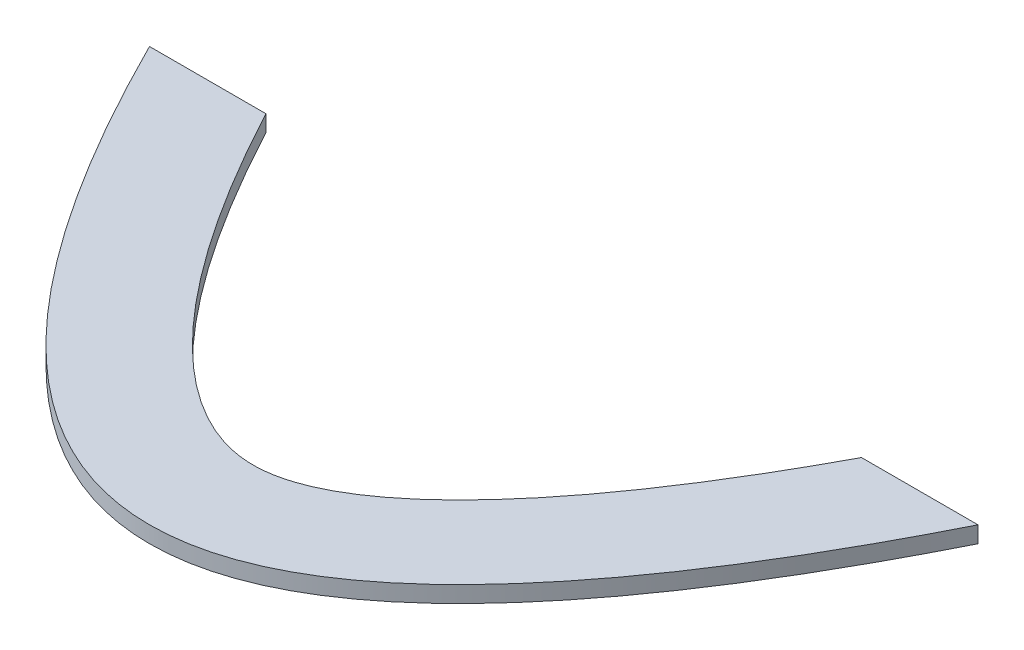
ISO-10303-21;
HEADER;
FILE_DESCRIPTION(('STEP AP214'),'2;1');
FILE_NAME('part.step','',(''),(''),'','','');
FILE_SCHEMA(('AUTOMOTIVE_DESIGN { 1 0 10303 214 1 1 1 1 }'));
ENDSEC;
DATA;
#1=APPLICATION_CONTEXT('core data for automotive mechanical design processes');
#2=APPLICATION_PROTOCOL_DEFINITION('international standard','automotive_design',2000,#1);
#3=PRODUCT_CONTEXT('',#1,'mechanical');
#4=PRODUCT('Part','Part','',(#3));
#5=PRODUCT_RELATED_PRODUCT_CATEGORY('part','',(#4));
#6=PRODUCT_DEFINITION_FORMATION('','',#4);
#7=PRODUCT_DEFINITION_CONTEXT('part definition',#1,'design');
#8=PRODUCT_DEFINITION('design','',#6,#7);
#9=PRODUCT_DEFINITION_SHAPE('','',#8);
#10=(LENGTH_UNIT() NAMED_UNIT(*) SI_UNIT(.MILLI.,.METRE.));
#11=(NAMED_UNIT(*) PLANE_ANGLE_UNIT() SI_UNIT($,.RADIAN.));
#12=(NAMED_UNIT(*) SI_UNIT($,.STERADIAN.) SOLID_ANGLE_UNIT());
#13=UNCERTAINTY_MEASURE_WITH_UNIT(LENGTH_MEASURE(1.E-05),#10,'distance_accuracy_value','');
#14=(GEOMETRIC_REPRESENTATION_CONTEXT(3) GLOBAL_UNCERTAINTY_ASSIGNED_CONTEXT((#13)) GLOBAL_UNIT_ASSIGNED_CONTEXT((#10,
#11,#12)) REPRESENTATION_CONTEXT('',''));
#15=CARTESIAN_POINT('',(0.,0.,0.));
#16=DIRECTION('',(0.,0.,1.));
#17=DIRECTION('',(1.,0.,0.));
#18=AXIS2_PLACEMENT_3D('',#15,#16,#17);
#19=CARTESIAN_POINT('',(-80.000000000081,3.175,-80.0000000001619));
#20=CARTESIAN_POINT('',(-1.79663575683442E-10,3.175,79.9999999998026));
#21=CARTESIAN_POINT('',(79.9999999997217,3.175,-79.9999999994433));
#22=B_SPLINE_CURVE_WITH_KNOTS('',2,(#19,#20,#21),.UNSPECIFIED.,.F.,.F.,(3,3),
(0.0560283962323778,0.943971603765628),.UNSPECIFIED.);
#23=DIRECTION('',(0.,-1.,0.));
#24=VECTOR('',#23,1.);
#25=SURFACE_OF_LINEAR_EXTRUSION('',#22,#24);
#26=CARTESIAN_POINT('',(-80.000000000081,0.,-80.0000000001619));
#27=CARTESIAN_POINT('',(-1.79663575683442E-10,0.,79.9999999998026));
#28=CARTESIAN_POINT('',(79.9999999997217,0.,-79.9999999994433));
#29=B_SPLINE_CURVE_WITH_KNOTS('',2,(#26,#27,#28),.UNSPECIFIED.,.F.,.F.,(3,3),
(0.0560283962323778,0.943971603765628),.UNSPECIFIED.);
#30=CARTESIAN_POINT('',(-80.000000000054,0.,-80.000000000108));
#31=VERTEX_POINT('',#30);
#32=CARTESIAN_POINT('',(80.0000000001213,0.,-79.9999999992711));
#33=VERTEX_POINT('',#32);
#34=EDGE_CURVE('E114',#31,#33,#29,.T.);
#35=ORIENTED_EDGE('',*,*,#34,.T.);
#36=DIRECTION('',(0.,-1.,0.));
#37=VECTOR('',#36,1.);
#38=CARTESIAN_POINT('',(80.0000000001213,3.175,-79.9999999992711));
#39=LINE('',#38,#37);
#40=CARTESIAN_POINT('',(80.0000000001213,3.175,-79.9999999992711));
#41=VERTEX_POINT('',#40);
#42=EDGE_CURVE('E11',#41,#33,#39,.T.);
#43=ORIENTED_EDGE('',*,*,#42,.F.);
#44=CARTESIAN_POINT('',(-80.000000000054,3.175,-80.000000000108));
#45=VERTEX_POINT('',#44);
#46=EDGE_CURVE('E84',#45,#41,#22,.T.);
#47=ORIENTED_EDGE('',*,*,#46,.F.);
#48=DIRECTION('',(0.,-1.,0.));
#49=VECTOR('',#48,1.);
#50=CARTESIAN_POINT('',(-80.000000000054,3.175,-80.000000000108));
#51=LINE('',#50,#49);
#52=EDGE_CURVE('E51',#45,#31,#51,.T.);
#53=ORIENTED_EDGE('',*,*,#52,.T.);
#54=EDGE_LOOP('',(#35,#43,#47,#53));
#55=FACE_BOUND('',#54,.T.);
#56=ADVANCED_FACE('F34',(#55),#25,.F.);
#57=CARTESIAN_POINT('',(80.0000000001213,3.175,-79.9999999992711));
#58=DIRECTION('',(0.,0.,1.));
#59=DIRECTION('',(1.,0.,0.));
#60=AXIS2_PLACEMENT_3D('',#57,#58,#59);
#61=PLANE('',#60);
#62=DIRECTION('',(-1.,0.,0.));
#63=VECTOR('',#62,1.);
#64=CARTESIAN_POINT('',(80.0000000001213,0.,-79.9999999992711));
#65=LINE('',#64,#63);
#66=CARTESIAN_POINT('',(57.4998467444385,0.,-80.0000007880775));
#67=VERTEX_POINT('',#66);
#68=EDGE_CURVE('E89',#33,#67,#65,.T.);
#69=ORIENTED_EDGE('',*,*,#68,.T.);
#70=DIRECTION('',(0.,-1.,0.));
#71=VECTOR('',#70,1.);
#72=CARTESIAN_POINT('',(57.4998467444385,3.175,-80.0000007880775));
#73=LINE('',#72,#71);
#74=CARTESIAN_POINT('',(57.4998467444385,3.175,-80.0000007880775));
#75=VERTEX_POINT('',#74);
#76=EDGE_CURVE('E43',#75,#67,#73,.T.);
#77=ORIENTED_EDGE('',*,*,#76,.F.);
#78=DIRECTION('',(-1.,0.,0.));
#79=VECTOR('',#78,1.);
#80=CARTESIAN_POINT('',(80.0000000001213,3.175,-79.9999999992711));
#81=LINE('',#80,#79);
#82=EDGE_CURVE('E76',#41,#75,#81,.T.);
#83=ORIENTED_EDGE('',*,*,#82,.F.);
#84=ORIENTED_EDGE('',*,*,#42,.T.);
#85=EDGE_LOOP('',(#69,#77,#83,#84));
#86=FACE_BOUND('',#85,.T.);
#87=ADVANCED_FACE('F88',(#86),#61,.F.);
#88=CARTESIAN_POINT('',(-62.1114561800424,3.175,-88.9442719100806));
#89=CARTESIAN_POINT('',(-61.7162611212567,3.175,-88.1538817925063));
#90=CARTESIAN_POINT('',(-60.9167732090005,3.175,-86.5673448246576));
#91=CARTESIAN_POINT('',(-59.3309928179829,3.175,-83.4702353816801));
#92=CARTESIAN_POINT('',(-57.3510014772479,3.175,-79.6959083735154));
#93=CARTESIAN_POINT('',(-54.9866500639018,3.175,-75.3368539581121));
#94=CARTESIAN_POINT('',(-51.848551557508,3.175,-69.7473246052211));
#95=CARTESIAN_POINT('',(-47.9568430259646,3.175,-63.1814902692598));
#96=CARTESIAN_POINT('',(-43.3467366278838,3.175,-55.9802385298903));
#97=CARTESIAN_POINT('',(-38.8101751420108,3.175,-49.4615791575551));
#98=CARTESIAN_POINT('',(-32.8822518695773,3.175,-41.684871694118));
#99=CARTESIAN_POINT('',(-25.7482146306752,3.175,-33.6867732285496));
#100=CARTESIAN_POINT('',(-17.8452684173484,3.175,-26.8212294392907));
#101=CARTESIAN_POINT('',(-10.8707116995545,3.175,-22.5283090121834));
#102=CARTESIAN_POINT('',(-5.006253323872,3.175,-20.3967974294962));
#103=CARTESIAN_POINT('',(1.41785671745054E-10,3.175,-19.8016012845364));
#104=CARTESIAN_POINT('',(5.00625332413443,3.175,-20.3967974294436));
#105=CARTESIAN_POINT('',(10.8707116997713,3.175,-22.5283090120529));
#106=CARTESIAN_POINT('',(17.845268417521,3.175,-26.8212294390591));
#107=CARTESIAN_POINT('',(25.7482146308147,3.175,-33.6867732282057));
#108=CARTESIAN_POINT('',(32.8822518696981,3.175,-41.6848716936779));
#109=CARTESIAN_POINT('',(38.8101751421204,3.175,-49.4615791570383));
#110=CARTESIAN_POINT('',(43.3467366279866,3.175,-55.9802385293162));
#111=CARTESIAN_POINT('',(47.9568430260619,3.175,-63.1814902686287));
#112=CARTESIAN_POINT('',(51.8485515576015,3.175,-69.7473246045429));
#113=CARTESIAN_POINT('',(54.9866500639927,3.175,-75.3368539573965));
#114=CARTESIAN_POINT('',(57.351001477337,3.175,-79.6959083727716));
#115=CARTESIAN_POINT('',(59.3309928180707,3.175,-83.4702353809133));
#116=CARTESIAN_POINT('',(60.9167732090873,3.175,-86.567344823872));
#117=CARTESIAN_POINT('',(61.716261121343,3.175,-88.1538817917115));
#118=CARTESIAN_POINT('',(62.1114561801284,3.175,-88.9442719092811));
#119=B_SPLINE_CURVE_WITH_KNOTS('',3,(#88,#89,#90,#91,#92,#93,#94,#95,#96,#97,#98,#99,#100,#101,
#102,#103,#104,#105,#106,#107,#108,#109,#110,#111,#112,#113,#114,#115,#116,#117,#118),
.UNSPECIFIED.,.F.,.F.,(4,1,1,1,1,1,1,1,1,1,1,1,1,1,1,1,1,1,1,1,1,1,1,1,1,1,1,1,4),
(0.0560283962311798,0.0629654525400494,0.0699025088489191,0.0837766214666585,0.0976507340843978,
0.111524846702137,0.139273071937616,0.167021297173095,0.194769522408573,0.222517747644052,
0.278014198115009,0.333510648585967,0.389007099056924,0.444503549527882,0.499999999998839,
0.555496450469796,0.610992900940754,0.666489351411711,0.721985801882669,0.777482252353626,
0.805230477589105,0.832978702824583,0.860726928060062,0.888475153295541,0.90234926591328,
0.91622337853102,0.930097491148759,0.937034547457629,0.943971603766498),.UNSPECIFIED.);
#120=DIRECTION('',(0.,-1.,0.));
#121=VECTOR('',#120,1.);
#122=SURFACE_OF_LINEAR_EXTRUSION('',#119,#121);
#123=CARTESIAN_POINT('',(-62.1114561800424,0.,-88.9442719100806));
#124=CARTESIAN_POINT('',(-61.7162611212567,0.,-88.1538817925063));
#125=CARTESIAN_POINT('',(-60.9167732090005,0.,-86.5673448246576));
#126=CARTESIAN_POINT('',(-59.3309928179829,0.,-83.4702353816801));
#127=CARTESIAN_POINT('',(-57.3510014772479,0.,-79.6959083735154));
#128=CARTESIAN_POINT('',(-54.9866500639018,0.,-75.3368539581121));
#129=CARTESIAN_POINT('',(-51.848551557508,0.,-69.7473246052211));
#130=CARTESIAN_POINT('',(-47.9568430259646,0.,-63.1814902692598));
#131=CARTESIAN_POINT('',(-43.3467366278838,0.,-55.9802385298903));
#132=CARTESIAN_POINT('',(-38.8101751420108,0.,-49.4615791575551));
#133=CARTESIAN_POINT('',(-32.8822518695773,0.,-41.684871694118));
#134=CARTESIAN_POINT('',(-25.7482146306752,0.,-33.6867732285496));
#135=CARTESIAN_POINT('',(-17.8452684173484,0.,-26.8212294392907));
#136=CARTESIAN_POINT('',(-10.8707116995545,0.,-22.5283090121834));
#137=CARTESIAN_POINT('',(-5.006253323872,0.,-20.3967974294962));
#138=CARTESIAN_POINT('',(1.41785671745054E-10,0.,-19.8016012845364));
#139=CARTESIAN_POINT('',(5.00625332413443,0.,-20.3967974294436));
#140=CARTESIAN_POINT('',(10.8707116997713,0.,-22.5283090120529));
#141=CARTESIAN_POINT('',(17.845268417521,0.,-26.8212294390591));
#142=CARTESIAN_POINT('',(25.7482146308147,0.,-33.6867732282057));
#143=CARTESIAN_POINT('',(32.8822518696981,0.,-41.6848716936779));
#144=CARTESIAN_POINT('',(38.8101751421204,0.,-49.4615791570383));
#145=CARTESIAN_POINT('',(43.3467366279866,0.,-55.9802385293162));
#146=CARTESIAN_POINT('',(47.9568430260619,0.,-63.1814902686287));
#147=CARTESIAN_POINT('',(51.8485515576015,0.,-69.7473246045429));
#148=CARTESIAN_POINT('',(54.9866500639927,0.,-75.3368539573965));
#149=CARTESIAN_POINT('',(57.351001477337,0.,-79.6959083727716));
#150=CARTESIAN_POINT('',(59.3309928180707,0.,-83.4702353809133));
#151=CARTESIAN_POINT('',(60.9167732090873,0.,-86.567344823872));
#152=CARTESIAN_POINT('',(61.716261121343,0.,-88.1538817917115));
#153=CARTESIAN_POINT('',(62.1114561801284,0.,-88.9442719092811));
#154=B_SPLINE_CURVE_WITH_KNOTS('',3,(#123,#124,#125,#126,#127,#128,#129,#130,#131,#132,#133,
#134,#135,#136,#137,#138,#139,#140,#141,#142,#143,#144,#145,#146,#147,#148,#149,#150,#151,#152,
#153),.UNSPECIFIED.,.F.,.F.,(4,1,1,1,1,1,1,1,1,1,1,1,1,1,1,1,1,1,1,1,1,1,1,1,1,1,1,1,4),
(0.0560283962311798,0.0629654525400494,0.0699025088489191,0.0837766214666585,0.0976507340843978,
0.111524846702137,0.139273071937616,0.167021297173095,0.194769522408573,0.222517747644052,
0.278014198115009,0.333510648585967,0.389007099056924,0.444503549527882,0.499999999998839,
0.555496450469796,0.610992900940754,0.666489351411711,0.721985801882669,0.777482252353626,
0.805230477589105,0.832978702824583,0.860726928060062,0.888475153295541,0.90234926591328,
0.91622337853102,0.930097491148759,0.937034547457629,0.943971603766498),.UNSPECIFIED.);
#155=CARTESIAN_POINT('',(-57.4998482264847,0.,-80.000000000108));
#156=VERTEX_POINT('',#155);
#157=EDGE_CURVE('E117',#156,#67,#154,.T.);
#158=ORIENTED_EDGE('',*,*,#157,.F.);
#159=DIRECTION('',(0.,-1.,0.));
#160=VECTOR('',#159,1.);
#161=CARTESIAN_POINT('',(-57.4998482264847,3.175,-80.000000000108));
#162=LINE('',#161,#160);
#163=CARTESIAN_POINT('',(-57.4998482264847,3.175,-80.000000000108));
#164=VERTEX_POINT('',#163);
#165=EDGE_CURVE('E65',#164,#156,#162,.T.);
#166=ORIENTED_EDGE('',*,*,#165,.F.);
#167=EDGE_CURVE('E83',#164,#75,#119,.T.);
#168=ORIENTED_EDGE('',*,*,#167,.T.);
#169=ORIENTED_EDGE('',*,*,#76,.T.);
#170=EDGE_LOOP('',(#158,#166,#168,#169));
#171=FACE_BOUND('',#170,.T.);
#172=ADVANCED_FACE('F92',(#171),#122,.T.);
#173=CARTESIAN_POINT('',(-80.000000000054,3.175,-80.000000000108));
#174=DIRECTION('',(0.,0.,-1.));
#175=DIRECTION('',(-1.,0.,0.));
#176=AXIS2_PLACEMENT_3D('',#173,#174,#175);
#177=PLANE('',#176);
#178=DIRECTION('',(1.,0.,0.));
#179=VECTOR('',#178,1.);
#180=CARTESIAN_POINT('',(-80.000000000054,0.,-80.000000000108));
#181=LINE('',#180,#179);
#182=EDGE_CURVE('E128',#31,#156,#181,.T.);
#183=ORIENTED_EDGE('',*,*,#182,.F.);
#184=ORIENTED_EDGE('',*,*,#52,.F.);
#185=DIRECTION('',(1.,0.,0.));
#186=VECTOR('',#185,1.);
#187=CARTESIAN_POINT('',(-80.000000000054,3.175,-80.000000000108));
#188=LINE('',#187,#186);
#189=EDGE_CURVE('E93',#45,#164,#188,.T.);
#190=ORIENTED_EDGE('',*,*,#189,.T.);
#191=ORIENTED_EDGE('',*,*,#165,.T.);
#192=EDGE_LOOP('',(#183,#184,#190,#191));
#193=FACE_BOUND('',#192,.T.);
#194=ADVANCED_FACE('F106',(#193),#177,.T.);
#195=CARTESIAN_POINT('',(-1.79665310406918E-10,3.175,0.));
#196=DIRECTION('',(0.,-1.,0.));
#197=DIRECTION('',(0.,0.,-1.));
#198=AXIS2_PLACEMENT_3D('',#195,#196,#197);
#199=PLANE('',#198);
#200=ORIENTED_EDGE('',*,*,#46,.T.);
#201=ORIENTED_EDGE('',*,*,#82,.T.);
#202=ORIENTED_EDGE('',*,*,#167,.F.);
#203=ORIENTED_EDGE('',*,*,#189,.F.);
#204=EDGE_LOOP('',(#200,#201,#202,#203));
#205=FACE_BOUND('',#204,.T.);
#206=ADVANCED_FACE('F80',(#205),#199,.F.);
#207=CARTESIAN_POINT('',(-1.79665310406918E-10,0.,0.));
#208=DIRECTION('',(0.,-1.,0.));
#209=DIRECTION('',(0.,0.,-1.));
#210=AXIS2_PLACEMENT_3D('',#207,#208,#209);
#211=PLANE('',#210);
#212=ORIENTED_EDGE('',*,*,#34,.F.);
#213=ORIENTED_EDGE('',*,*,#182,.T.);
#214=ORIENTED_EDGE('',*,*,#157,.T.);
#215=ORIENTED_EDGE('',*,*,#68,.F.);
#216=EDGE_LOOP('',(#212,#213,#214,#215));
#217=FACE_BOUND('',#216,.T.);
#218=ADVANCED_FACE('F140',(#217),#211,.T.);
#219=CLOSED_SHELL('',(#56,#87,#172,#194,#206,#218));
#220=MANIFOLD_SOLID_BREP('B2',#219);
#221=ADVANCED_BREP_SHAPE_REPRESENTATION('',(#18,#220),#14);
#222=SHAPE_DEFINITION_REPRESENTATION(#9,#221);
ENDSEC;
END-ISO-10303-21;
